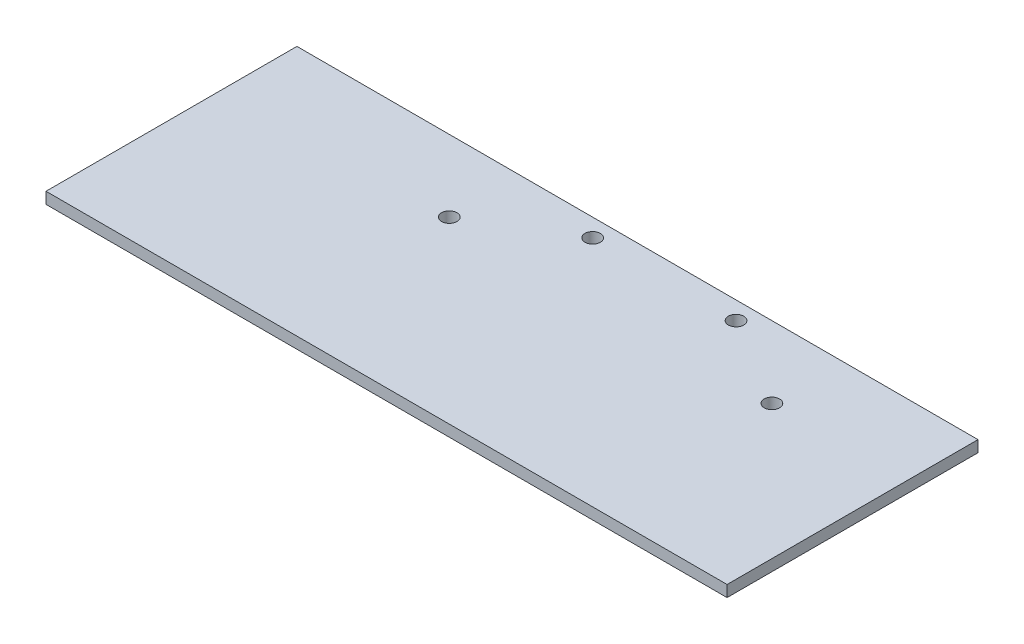
ISO-10303-21;
HEADER;
FILE_DESCRIPTION(('STEP AP214'),'2;1');
FILE_NAME('part.step','',(''),(''),'','','');
FILE_SCHEMA(('AUTOMOTIVE_DESIGN { 1 0 10303 214 1 1 1 1 }'));
ENDSEC;
DATA;
#1=APPLICATION_CONTEXT('core data for automotive mechanical design processes');
#2=APPLICATION_PROTOCOL_DEFINITION('international standard','automotive_design',2000,#1);
#3=PRODUCT_CONTEXT('',#1,'mechanical');
#4=PRODUCT('Part','Part','',(#3));
#5=PRODUCT_RELATED_PRODUCT_CATEGORY('part','',(#4));
#6=PRODUCT_DEFINITION_FORMATION('','',#4);
#7=PRODUCT_DEFINITION_CONTEXT('part definition',#1,'design');
#8=PRODUCT_DEFINITION('design','',#6,#7);
#9=PRODUCT_DEFINITION_SHAPE('','',#8);
#10=(LENGTH_UNIT() NAMED_UNIT(*) SI_UNIT(.MILLI.,.METRE.));
#11=(NAMED_UNIT(*) PLANE_ANGLE_UNIT() SI_UNIT($,.RADIAN.));
#12=(NAMED_UNIT(*) SI_UNIT($,.STERADIAN.) SOLID_ANGLE_UNIT());
#13=UNCERTAINTY_MEASURE_WITH_UNIT(LENGTH_MEASURE(1.E-05),#10,'distance_accuracy_value','');
#14=(GEOMETRIC_REPRESENTATION_CONTEXT(3) GLOBAL_UNCERTAINTY_ASSIGNED_CONTEXT((#13)) GLOBAL_UNIT_ASSIGNED_CONTEXT((#10,
#11,#12)) REPRESENTATION_CONTEXT('',''));
#15=CARTESIAN_POINT('',(0.,0.,0.));
#16=DIRECTION('',(0.,0.,1.));
#17=DIRECTION('',(1.,0.,0.));
#18=AXIS2_PLACEMENT_3D('',#15,#16,#17);
#19=CARTESIAN_POINT('',(0.,1.5875,0.));
#20=DIRECTION('',(0.,-1.,0.));
#21=DIRECTION('',(0.,0.,-1.));
#22=AXIS2_PLACEMENT_3D('',#19,#20,#21);
#23=PLANE('',#22);
#24=DIRECTION('',(0.,0.,-1.));
#25=VECTOR('',#24,1.);
#26=CARTESIAN_POINT('',(82.5,1.5875,65.));
#27=LINE('',#26,#25);
#28=CARTESIAN_POINT('',(82.5,1.5875,65.));
#29=VERTEX_POINT('',#28);
#30=CARTESIAN_POINT('',(82.5,1.5875,-5.00000000000001));
#31=VERTEX_POINT('',#30);
#32=EDGE_CURVE('E98',#29,#31,#27,.T.);
#33=ORIENTED_EDGE('',*,*,#32,.T.);
#34=DIRECTION('',(-1.,0.,0.));
#35=VECTOR('',#34,1.);
#36=CARTESIAN_POINT('',(-107.5,1.5875,-5.));
#37=LINE('',#36,#35);
#38=CARTESIAN_POINT('',(-107.5,1.5875,-5.));
#39=VERTEX_POINT('',#38);
#40=EDGE_CURVE('E93',#31,#39,#37,.T.);
#41=ORIENTED_EDGE('',*,*,#40,.T.);
#42=DIRECTION('',(0.,0.,1.));
#43=VECTOR('',#42,1.);
#44=CARTESIAN_POINT('',(-107.5,1.5875,65.));
#45=LINE('',#44,#43);
#46=CARTESIAN_POINT('',(-107.5,1.5875,65.));
#47=VERTEX_POINT('',#46);
#48=EDGE_CURVE('E96',#39,#47,#45,.T.);
#49=ORIENTED_EDGE('',*,*,#48,.T.);
#50=DIRECTION('',(1.,0.,0.));
#51=VECTOR('',#50,1.);
#52=CARTESIAN_POINT('',(-107.5,1.5875,65.));
#53=LINE('',#52,#51);
#54=EDGE_CURVE('E63',#47,#29,#53,.T.);
#55=ORIENTED_EDGE('',*,*,#54,.T.);
#56=EDGE_LOOP('',(#33,#41,#49,#55));
#57=FACE_BOUND('',#56,.T.);
#58=CARTESIAN_POINT('',(-20.,1.5875,0.));
#59=DIRECTION('',(0.,1.,0.));
#60=DIRECTION('',(0.,0.,1.));
#61=AXIS2_PLACEMENT_3D('',#58,#59,#60);
#62=CIRCLE('',#61,2.15);
#63=CARTESIAN_POINT('',(-20.,1.5875,2.15));
#64=VERTEX_POINT('',#63);
#65=EDGE_CURVE('E118',#64,#64,#62,.T.);
#66=ORIENTED_EDGE('',*,*,#65,.F.);
#67=EDGE_LOOP('',(#66));
#68=FACE_BOUND('',#67,.T.);
#69=CARTESIAN_POINT('',(20.,1.5875,0.));
#70=DIRECTION('',(0.,1.,0.));
#71=DIRECTION('',(0.,0.,1.));
#72=AXIS2_PLACEMENT_3D('',#69,#70,#71);
#73=CIRCLE('',#72,2.15);
#74=CARTESIAN_POINT('',(20.,1.5875,2.15));
#75=VERTEX_POINT('',#74);
#76=EDGE_CURVE('E140',#75,#75,#73,.T.);
#77=ORIENTED_EDGE('',*,*,#76,.F.);
#78=EDGE_LOOP('',(#77));
#79=FACE_BOUND('',#78,.T.);
#80=CARTESIAN_POINT('',(45.,1.5875,15.));
#81=DIRECTION('',(0.,1.,0.));
#82=DIRECTION('',(0.,0.,1.));
#83=AXIS2_PLACEMENT_3D('',#80,#81,#82);
#84=CIRCLE('',#83,2.15);
#85=CARTESIAN_POINT('',(45.,1.5875,17.15));
#86=VERTEX_POINT('',#85);
#87=EDGE_CURVE('E148',#86,#86,#84,.T.);
#88=ORIENTED_EDGE('',*,*,#87,.F.);
#89=EDGE_LOOP('',(#88));
#90=FACE_BOUND('',#89,.T.);
#91=CARTESIAN_POINT('',(-45.,1.5875,15.));
#92=DIRECTION('',(0.,1.,0.));
#93=DIRECTION('',(0.,0.,1.));
#94=AXIS2_PLACEMENT_3D('',#91,#92,#93);
#95=CIRCLE('',#94,2.15);
#96=CARTESIAN_POINT('',(-45.,1.5875,17.15));
#97=VERTEX_POINT('',#96);
#98=EDGE_CURVE('E156',#97,#97,#95,.T.);
#99=ORIENTED_EDGE('',*,*,#98,.F.);
#100=EDGE_LOOP('',(#99));
#101=FACE_BOUND('',#100,.T.);
#102=ADVANCED_FACE('F45',(#57,#68,#79,#90,#101),#23,.F.);
#103=CARTESIAN_POINT('',(0.,-1.5875,0.));
#104=DIRECTION('',(0.,-1.,0.));
#105=DIRECTION('',(0.,0.,-1.));
#106=AXIS2_PLACEMENT_3D('',#103,#104,#105);
#107=PLANE('',#106);
#108=CARTESIAN_POINT('',(45.,-1.5875,15.));
#109=DIRECTION('',(0.,1.,0.));
#110=DIRECTION('',(0.,0.,1.));
#111=AXIS2_PLACEMENT_3D('',#108,#109,#110);
#112=CIRCLE('',#111,2.15);
#113=CARTESIAN_POINT('',(45.,-1.5875,17.15));
#114=VERTEX_POINT('',#113);
#115=EDGE_CURVE('E152',#114,#114,#112,.T.);
#116=ORIENTED_EDGE('',*,*,#115,.T.);
#117=EDGE_LOOP('',(#116));
#118=FACE_BOUND('',#117,.T.);
#119=CARTESIAN_POINT('',(-20.,-1.5875,0.));
#120=DIRECTION('',(0.,1.,0.));
#121=DIRECTION('',(0.,0.,1.));
#122=AXIS2_PLACEMENT_3D('',#119,#120,#121);
#123=CIRCLE('',#122,2.15);
#124=CARTESIAN_POINT('',(-20.,-1.5875,2.15));
#125=VERTEX_POINT('',#124);
#126=EDGE_CURVE('E136',#125,#125,#123,.T.);
#127=ORIENTED_EDGE('',*,*,#126,.T.);
#128=EDGE_LOOP('',(#127));
#129=FACE_BOUND('',#128,.T.);
#130=DIRECTION('',(0.,0.,-1.));
#131=VECTOR('',#130,1.);
#132=CARTESIAN_POINT('',(82.5,-1.5875,65.));
#133=LINE('',#132,#131);
#134=CARTESIAN_POINT('',(82.5,-1.5875,65.));
#135=VERTEX_POINT('',#134);
#136=CARTESIAN_POINT('',(82.5,-1.5875,-5.00000000000001));
#137=VERTEX_POINT('',#136);
#138=EDGE_CURVE('E114',#135,#137,#133,.T.);
#139=ORIENTED_EDGE('',*,*,#138,.F.);
#140=DIRECTION('',(1.,0.,0.));
#141=VECTOR('',#140,1.);
#142=CARTESIAN_POINT('',(-107.5,-1.5875,65.));
#143=LINE('',#142,#141);
#144=CARTESIAN_POINT('',(-107.5,-1.5875,65.));
#145=VERTEX_POINT('',#144);
#146=EDGE_CURVE('E86',#145,#135,#143,.T.);
#147=ORIENTED_EDGE('',*,*,#146,.F.);
#148=DIRECTION('',(0.,0.,1.));
#149=VECTOR('',#148,1.);
#150=CARTESIAN_POINT('',(-107.5,-1.5875,65.));
#151=LINE('',#150,#149);
#152=CARTESIAN_POINT('',(-107.5,-1.5875,-5.));
#153=VERTEX_POINT('',#152);
#154=EDGE_CURVE('E80',#153,#145,#151,.T.);
#155=ORIENTED_EDGE('',*,*,#154,.F.);
#156=DIRECTION('',(-1.,0.,0.));
#157=VECTOR('',#156,1.);
#158=CARTESIAN_POINT('',(-107.5,-1.5875,-5.));
#159=LINE('',#158,#157);
#160=EDGE_CURVE('E103',#137,#153,#159,.T.);
#161=ORIENTED_EDGE('',*,*,#160,.F.);
#162=EDGE_LOOP('',(#139,#147,#155,#161));
#163=FACE_BOUND('',#162,.T.);
#164=CARTESIAN_POINT('',(20.,-1.5875,0.));
#165=DIRECTION('',(0.,1.,0.));
#166=DIRECTION('',(0.,0.,1.));
#167=AXIS2_PLACEMENT_3D('',#164,#165,#166);
#168=CIRCLE('',#167,2.15);
#169=CARTESIAN_POINT('',(20.,-1.5875,2.15));
#170=VERTEX_POINT('',#169);
#171=EDGE_CURVE('E144',#170,#170,#168,.T.);
#172=ORIENTED_EDGE('',*,*,#171,.T.);
#173=EDGE_LOOP('',(#172));
#174=FACE_BOUND('',#173,.T.);
#175=CARTESIAN_POINT('',(-45.,-1.5875,15.));
#176=DIRECTION('',(0.,1.,0.));
#177=DIRECTION('',(0.,0.,1.));
#178=AXIS2_PLACEMENT_3D('',#175,#176,#177);
#179=CIRCLE('',#178,2.15);
#180=CARTESIAN_POINT('',(-45.,-1.5875,17.15));
#181=VERTEX_POINT('',#180);
#182=EDGE_CURVE('E160',#181,#181,#179,.T.);
#183=ORIENTED_EDGE('',*,*,#182,.T.);
#184=EDGE_LOOP('',(#183));
#185=FACE_BOUND('',#184,.T.);
#186=ADVANCED_FACE('F131',(#118,#129,#163,#174,#185),#107,.T.);
#187=CARTESIAN_POINT('',(82.5,1.5875,65.));
#188=DIRECTION('',(-1.,0.,0.));
#189=DIRECTION('',(0.,0.,1.));
#190=AXIS2_PLACEMENT_3D('',#187,#188,#189);
#191=PLANE('',#190);
#192=ORIENTED_EDGE('',*,*,#138,.T.);
#193=DIRECTION('',(0.,-1.,0.));
#194=VECTOR('',#193,1.);
#195=CARTESIAN_POINT('',(82.5,1.5875,-5.00000000000001));
#196=LINE('',#195,#194);
#197=EDGE_CURVE('E11',#31,#137,#196,.T.);
#198=ORIENTED_EDGE('',*,*,#197,.F.);
#199=ORIENTED_EDGE('',*,*,#32,.F.);
#200=DIRECTION('',(0.,-1.,0.));
#201=VECTOR('',#200,1.);
#202=CARTESIAN_POINT('',(82.5,1.5875,65.));
#203=LINE('',#202,#201);
#204=EDGE_CURVE('E110',#29,#135,#203,.T.);
#205=ORIENTED_EDGE('',*,*,#204,.T.);
#206=EDGE_LOOP('',(#192,#198,#199,#205));
#207=FACE_BOUND('',#206,.T.);
#208=ADVANCED_FACE('F47',(#207),#191,.F.);
#209=CARTESIAN_POINT('',(-107.5,1.5875,-5.));
#210=DIRECTION('',(0.,0.,1.));
#211=DIRECTION('',(1.,0.,0.));
#212=AXIS2_PLACEMENT_3D('',#209,#210,#211);
#213=PLANE('',#212);
#214=ORIENTED_EDGE('',*,*,#160,.T.);
#215=DIRECTION('',(0.,-1.,0.));
#216=VECTOR('',#215,1.);
#217=CARTESIAN_POINT('',(-107.5,1.5875,-5.));
#218=LINE('',#217,#216);
#219=EDGE_CURVE('E55',#39,#153,#218,.T.);
#220=ORIENTED_EDGE('',*,*,#219,.F.);
#221=ORIENTED_EDGE('',*,*,#40,.F.);
#222=ORIENTED_EDGE('',*,*,#197,.T.);
#223=EDGE_LOOP('',(#214,#220,#221,#222));
#224=FACE_BOUND('',#223,.T.);
#225=ADVANCED_FACE('F102',(#224),#213,.F.);
#226=CARTESIAN_POINT('',(-107.5,1.5875,65.));
#227=DIRECTION('',(1.,0.,0.));
#228=DIRECTION('',(0.,0.,-1.));
#229=AXIS2_PLACEMENT_3D('',#226,#227,#228);
#230=PLANE('',#229);
#231=ORIENTED_EDGE('',*,*,#154,.T.);
#232=DIRECTION('',(0.,-1.,0.));
#233=VECTOR('',#232,1.);
#234=CARTESIAN_POINT('',(-107.5,1.5875,65.));
#235=LINE('',#234,#233);
#236=EDGE_CURVE('E105',#47,#145,#235,.T.);
#237=ORIENTED_EDGE('',*,*,#236,.F.);
#238=ORIENTED_EDGE('',*,*,#48,.F.);
#239=ORIENTED_EDGE('',*,*,#219,.T.);
#240=EDGE_LOOP('',(#231,#237,#238,#239));
#241=FACE_BOUND('',#240,.T.);
#242=ADVANCED_FACE('F106',(#241),#230,.F.);
#243=CARTESIAN_POINT('',(-107.5,1.5875,65.));
#244=DIRECTION('',(0.,0.,-1.));
#245=DIRECTION('',(-1.,0.,0.));
#246=AXIS2_PLACEMENT_3D('',#243,#244,#245);
#247=PLANE('',#246);
#248=ORIENTED_EDGE('',*,*,#146,.T.);
#249=ORIENTED_EDGE('',*,*,#204,.F.);
#250=ORIENTED_EDGE('',*,*,#54,.F.);
#251=ORIENTED_EDGE('',*,*,#236,.T.);
#252=EDGE_LOOP('',(#248,#249,#250,#251));
#253=FACE_BOUND('',#252,.T.);
#254=ADVANCED_FACE('F128',(#253),#247,.F.);
#255=CARTESIAN_POINT('',(-20.,1.5875,0.));
#256=DIRECTION('',(0.,-1.,0.));
#257=DIRECTION('',(0.,0.,-1.));
#258=AXIS2_PLACEMENT_3D('',#255,#256,#257);
#259=CYLINDRICAL_SURFACE('',#258,2.15);
#260=ORIENTED_EDGE('',*,*,#65,.T.);
#261=EDGE_LOOP('',(#260));
#262=FACE_BOUND('',#261,.T.);
#263=ORIENTED_EDGE('',*,*,#126,.F.);
#264=EDGE_LOOP('',(#263));
#265=FACE_BOUND('',#264,.T.);
#266=ADVANCED_FACE('F179',(#262,#265),#259,.F.);
#267=CARTESIAN_POINT('',(20.,1.5875,0.));
#268=DIRECTION('',(0.,-1.,0.));
#269=DIRECTION('',(0.,0.,-1.));
#270=AXIS2_PLACEMENT_3D('',#267,#268,#269);
#271=CYLINDRICAL_SURFACE('',#270,2.15);
#272=ORIENTED_EDGE('',*,*,#76,.T.);
#273=EDGE_LOOP('',(#272));
#274=FACE_BOUND('',#273,.T.);
#275=ORIENTED_EDGE('',*,*,#171,.F.);
#276=EDGE_LOOP('',(#275));
#277=FACE_BOUND('',#276,.T.);
#278=ADVANCED_FACE('F224',(#274,#277),#271,.F.);
#279=CARTESIAN_POINT('',(45.,1.5875,15.));
#280=DIRECTION('',(0.,-1.,0.));
#281=DIRECTION('',(0.,0.,-1.));
#282=AXIS2_PLACEMENT_3D('',#279,#280,#281);
#283=CYLINDRICAL_SURFACE('',#282,2.15);
#284=ORIENTED_EDGE('',*,*,#87,.T.);
#285=EDGE_LOOP('',(#284));
#286=FACE_BOUND('',#285,.T.);
#287=ORIENTED_EDGE('',*,*,#115,.F.);
#288=EDGE_LOOP('',(#287));
#289=FACE_BOUND('',#288,.T.);
#290=ADVANCED_FACE('F232',(#286,#289),#283,.F.);
#291=CARTESIAN_POINT('',(-45.,1.5875,15.));
#292=DIRECTION('',(0.,-1.,0.));
#293=DIRECTION('',(0.,0.,-1.));
#294=AXIS2_PLACEMENT_3D('',#291,#292,#293);
#295=CYLINDRICAL_SURFACE('',#294,2.15);
#296=ORIENTED_EDGE('',*,*,#98,.T.);
#297=EDGE_LOOP('',(#296));
#298=FACE_BOUND('',#297,.T.);
#299=ORIENTED_EDGE('',*,*,#182,.F.);
#300=EDGE_LOOP('',(#299));
#301=FACE_BOUND('',#300,.T.);
#302=ADVANCED_FACE('F168',(#298,#301),#295,.F.);
#303=CLOSED_SHELL('',(#102,#186,#208,#225,#242,#254,#266,#278,#290,#302));
#304=MANIFOLD_SOLID_BREP('B2',#303);
#305=ADVANCED_BREP_SHAPE_REPRESENTATION('',(#18,#304),#14);
#306=SHAPE_DEFINITION_REPRESENTATION(#9,#305);
ENDSEC;
END-ISO-10303-21;
